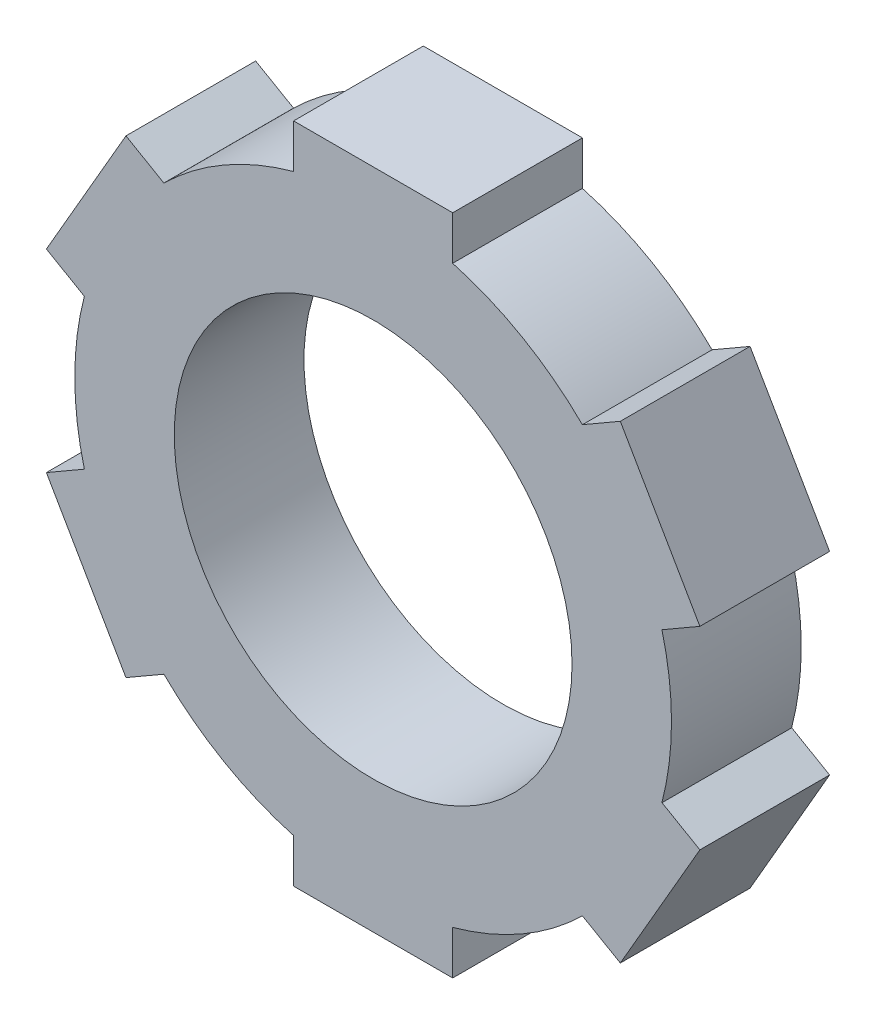
ISO-10303-21;
HEADER;
FILE_DESCRIPTION(('STEP AP214'),'2;1');
FILE_NAME('part.step','',(''),(''),'','','');
FILE_SCHEMA(('AUTOMOTIVE_DESIGN { 1 0 10303 214 1 1 1 1 }'));
ENDSEC;
DATA;
#1=APPLICATION_CONTEXT('core data for automotive mechanical design processes');
#2=APPLICATION_PROTOCOL_DEFINITION('international standard','automotive_design',2000,#1);
#3=PRODUCT_CONTEXT('',#1,'mechanical');
#4=PRODUCT('Part','Part','',(#3));
#5=PRODUCT_RELATED_PRODUCT_CATEGORY('part','',(#4));
#6=PRODUCT_DEFINITION_FORMATION('','',#4);
#7=PRODUCT_DEFINITION_CONTEXT('part definition',#1,'design');
#8=PRODUCT_DEFINITION('design','',#6,#7);
#9=PRODUCT_DEFINITION_SHAPE('','',#8);
#10=(LENGTH_UNIT() NAMED_UNIT(*) SI_UNIT(.MILLI.,.METRE.));
#11=(NAMED_UNIT(*) PLANE_ANGLE_UNIT() SI_UNIT($,.RADIAN.));
#12=(NAMED_UNIT(*) SI_UNIT($,.STERADIAN.) SOLID_ANGLE_UNIT());
#13=UNCERTAINTY_MEASURE_WITH_UNIT(LENGTH_MEASURE(1.E-05),#10,'distance_accuracy_value','');
#14=(GEOMETRIC_REPRESENTATION_CONTEXT(3) GLOBAL_UNCERTAINTY_ASSIGNED_CONTEXT((#13)) GLOBAL_UNIT_ASSIGNED_CONTEXT((#10,
#11,#12)) REPRESENTATION_CONTEXT('',''));
#15=CARTESIAN_POINT('',(0.,0.,0.));
#16=DIRECTION('',(0.,0.,1.));
#17=DIRECTION('',(1.,0.,0.));
#18=AXIS2_PLACEMENT_3D('',#15,#16,#17);
#19=CARTESIAN_POINT('',(0.,0.,3.75));
#20=DIRECTION('',(0.,0.,-1.));
#21=DIRECTION('',(-1.,0.,0.));
#22=AXIS2_PLACEMENT_3D('',#19,#20,#21);
#23=CYLINDRICAL_SURFACE('',#22,17.25);
#24=DIRECTION('',(0.,0.,-1.));
#25=VECTOR('',#24,1.);
#26=CARTESIAN_POINT('',(16.694543239469,4.34220290008433,3.75));
#27=LINE('',#26,#25);
#28=CARTESIAN_POINT('',(16.694543239469,4.34220290008433,3.75));
#29=VERTEX_POINT('',#28);
#30=CARTESIAN_POINT('',(16.694543239469,4.34220290008433,-3.75));
#31=VERTEX_POINT('',#30);
#32=EDGE_CURVE('E326',#29,#31,#27,.T.);
#33=ORIENTED_EDGE('',*,*,#32,.F.);
#34=CARTESIAN_POINT('',(0.,0.,3.75));
#35=DIRECTION('',(0.,0.,1.));
#36=DIRECTION('',(1.,0.,0.));
#37=AXIS2_PLACEMENT_3D('',#34,#35,#36);
#38=CIRCLE('',#37,17.25);
#39=CARTESIAN_POINT('',(16.6945432394691,-4.34220290008398,3.75));
#40=VERTEX_POINT('',#39);
#41=EDGE_CURVE('E283',#40,#29,#38,.T.);
#42=ORIENTED_EDGE('',*,*,#41,.F.);
#43=DIRECTION('',(0.,0.,-1.));
#44=VECTOR('',#43,1.);
#45=CARTESIAN_POINT('',(16.6945432394691,-4.34220290008398,3.75));
#46=LINE('',#45,#44);
#47=CARTESIAN_POINT('',(16.6945432394691,-4.34220290008398,-3.75));
#48=VERTEX_POINT('',#47);
#49=EDGE_CURVE('E352',#48,#40,#46,.F.);
#50=ORIENTED_EDGE('',*,*,#49,.F.);
#51=CARTESIAN_POINT('',(0.,0.,-3.75));
#52=DIRECTION('',(0.,0.,1.));
#53=DIRECTION('',(1.,0.,0.));
#54=AXIS2_PLACEMENT_3D('',#51,#52,#53);
#55=CIRCLE('',#54,17.25);
#56=EDGE_CURVE('E657',#48,#31,#55,.T.);
#57=ORIENTED_EDGE('',*,*,#56,.T.);
#58=EDGE_LOOP('',(#33,#42,#50,#57));
#59=FACE_BOUND('',#58,.T.);
#60=ADVANCED_FACE('F43',(#59),#23,.T.);
#61=DIRECTION('',(0.,0.,-1.));
#62=VECTOR('',#61,1.);
#63=CARTESIAN_POINT('',(12.1077296395937,12.286797099916,3.75));
#64=LINE('',#63,#62);
#65=CARTESIAN_POINT('',(12.1077296395937,12.286797099916,-3.75));
#66=VERTEX_POINT('',#65);
#67=CARTESIAN_POINT('',(12.1077296395937,12.286797099916,3.75));
#68=VERTEX_POINT('',#67);
#69=EDGE_CURVE('E323',#66,#68,#64,.F.);
#70=ORIENTED_EDGE('',*,*,#69,.F.);
#71=CARTESIAN_POINT('',(4.58681359987519,16.629,-3.75));
#72=VERTEX_POINT('',#71);
#73=EDGE_CURVE('E584',#66,#72,#55,.T.);
#74=ORIENTED_EDGE('',*,*,#73,.T.);
#75=DIRECTION('',(0.,0.,-1.));
#76=VECTOR('',#75,1.);
#77=CARTESIAN_POINT('',(4.58681359987519,16.629,3.75));
#78=LINE('',#77,#76);
#79=CARTESIAN_POINT('',(4.58681359987519,16.629,3.75));
#80=VERTEX_POINT('',#79);
#81=EDGE_CURVE('E11',#80,#72,#78,.T.);
#82=ORIENTED_EDGE('',*,*,#81,.F.);
#83=EDGE_CURVE('E593',#68,#80,#38,.T.);
#84=ORIENTED_EDGE('',*,*,#83,.F.);
#85=EDGE_LOOP('',(#70,#74,#82,#84));
#86=FACE_BOUND('',#85,.T.);
#87=ADVANCED_FACE('F654',(#86),#23,.T.);
#88=DIRECTION('',(0.,0.,-1.));
#89=VECTOR('',#88,1.);
#90=CARTESIAN_POINT('',(12.1077296395939,-12.2867970999158,3.75));
#91=LINE('',#90,#89);
#92=CARTESIAN_POINT('',(12.1077296395939,-12.2867970999158,3.75));
#93=VERTEX_POINT('',#92);
#94=CARTESIAN_POINT('',(12.1077296395939,-12.2867970999158,-3.75));
#95=VERTEX_POINT('',#94);
#96=EDGE_CURVE('E375',#93,#95,#91,.T.);
#97=ORIENTED_EDGE('',*,*,#96,.F.);
#98=CARTESIAN_POINT('',(4.58681359987519,-16.629,3.75));
#99=VERTEX_POINT('',#98);
#100=EDGE_CURVE('E702',#99,#93,#38,.T.);
#101=ORIENTED_EDGE('',*,*,#100,.F.);
#102=DIRECTION('',(0.,0.,-1.));
#103=VECTOR('',#102,1.);
#104=CARTESIAN_POINT('',(4.58681359987519,-16.629,3.75));
#105=LINE('',#104,#103);
#106=CARTESIAN_POINT('',(4.58681359987519,-16.629,-3.75));
#107=VERTEX_POINT('',#106);
#108=EDGE_CURVE('E402',#107,#99,#105,.F.);
#109=ORIENTED_EDGE('',*,*,#108,.F.);
#110=EDGE_CURVE('E660',#107,#95,#55,.T.);
#111=ORIENTED_EDGE('',*,*,#110,.T.);
#112=EDGE_LOOP('',(#97,#101,#109,#111));
#113=FACE_BOUND('',#112,.T.);
#114=ADVANCED_FACE('F735',(#113),#23,.T.);
#115=DIRECTION('',(0.,0.,-1.));
#116=VECTOR('',#115,1.);
#117=CARTESIAN_POINT('',(-4.58681359987519,-16.629,3.75));
#118=LINE('',#117,#116);
#119=CARTESIAN_POINT('',(-4.58681359987519,-16.629,3.75));
#120=VERTEX_POINT('',#119);
#121=CARTESIAN_POINT('',(-4.58681359987519,-16.629,-3.75));
#122=VERTEX_POINT('',#121);
#123=EDGE_CURVE('E427',#120,#122,#118,.T.);
#124=ORIENTED_EDGE('',*,*,#123,.F.);
#125=CARTESIAN_POINT('',(-12.1077296395938,-12.2867970999159,3.75));
#126=VERTEX_POINT('',#125);
#127=EDGE_CURVE('E699',#126,#120,#38,.T.);
#128=ORIENTED_EDGE('',*,*,#127,.F.);
#129=DIRECTION('',(0.,0.,-1.));
#130=VECTOR('',#129,1.);
#131=CARTESIAN_POINT('',(-12.1077296395938,-12.2867970999159,3.75));
#132=LINE('',#131,#130);
#133=CARTESIAN_POINT('',(-12.1077296395938,-12.2867970999159,-3.75));
#134=VERTEX_POINT('',#133);
#135=EDGE_CURVE('E454',#134,#126,#132,.F.);
#136=ORIENTED_EDGE('',*,*,#135,.F.);
#137=EDGE_CURVE('E666',#134,#122,#55,.T.);
#138=ORIENTED_EDGE('',*,*,#137,.T.);
#139=EDGE_LOOP('',(#124,#128,#136,#138));
#140=FACE_BOUND('',#139,.T.);
#141=ADVANCED_FACE('F742',(#140),#23,.T.);
#142=DIRECTION('',(0.,0.,-1.));
#143=VECTOR('',#142,1.);
#144=CARTESIAN_POINT('',(-16.694543239469,-4.34220290008422,3.75));
#145=LINE('',#144,#143);
#146=CARTESIAN_POINT('',(-16.694543239469,-4.34220290008422,3.75));
#147=VERTEX_POINT('',#146);
#148=CARTESIAN_POINT('',(-16.694543239469,-4.34220290008422,-3.75));
#149=VERTEX_POINT('',#148);
#150=EDGE_CURVE('E479',#147,#149,#145,.T.);
#151=ORIENTED_EDGE('',*,*,#150,.F.);
#152=CARTESIAN_POINT('',(-16.694543239469,4.34220290008409,3.75));
#153=VERTEX_POINT('',#152);
#154=EDGE_CURVE('E592',#153,#147,#38,.T.);
#155=ORIENTED_EDGE('',*,*,#154,.F.);
#156=DIRECTION('',(0.,0.,-1.));
#157=VECTOR('',#156,1.);
#158=CARTESIAN_POINT('',(-16.694543239469,4.34220290008409,3.75));
#159=LINE('',#158,#157);
#160=CARTESIAN_POINT('',(-16.694543239469,4.34220290008409,-3.75));
#161=VERTEX_POINT('',#160);
#162=EDGE_CURVE('E506',#161,#153,#159,.F.);
#163=ORIENTED_EDGE('',*,*,#162,.F.);
#164=EDGE_CURVE('E597',#161,#149,#55,.T.);
#165=ORIENTED_EDGE('',*,*,#164,.T.);
#166=EDGE_LOOP('',(#151,#155,#163,#165));
#167=FACE_BOUND('',#166,.T.);
#168=ADVANCED_FACE('F683',(#167),#23,.T.);
#169=DIRECTION('',(0.,0.,-1.));
#170=VECTOR('',#169,1.);
#171=CARTESIAN_POINT('',(-12.1077296395939,12.2867970999158,3.75));
#172=LINE('',#171,#170);
#173=CARTESIAN_POINT('',(-12.1077296395939,12.2867970999158,3.75));
#174=VERTEX_POINT('',#173);
#175=CARTESIAN_POINT('',(-12.1077296395939,12.2867970999158,-3.75));
#176=VERTEX_POINT('',#175);
#177=EDGE_CURVE('E531',#174,#176,#172,.T.);
#178=ORIENTED_EDGE('',*,*,#177,.F.);
#179=CARTESIAN_POINT('',(-4.58681359987519,16.629,3.75));
#180=VERTEX_POINT('',#179);
#181=EDGE_CURVE('E588',#180,#174,#38,.T.);
#182=ORIENTED_EDGE('',*,*,#181,.F.);
#183=DIRECTION('',(0.,0.,-1.));
#184=VECTOR('',#183,1.);
#185=CARTESIAN_POINT('',(-4.58681359987519,16.629,3.75));
#186=LINE('',#185,#184);
#187=CARTESIAN_POINT('',(-4.58681359987519,16.629,-3.75));
#188=VERTEX_POINT('',#187);
#189=EDGE_CURVE('E52',#188,#180,#186,.F.);
#190=ORIENTED_EDGE('',*,*,#189,.F.);
#191=EDGE_CURVE('E594',#188,#176,#55,.T.);
#192=ORIENTED_EDGE('',*,*,#191,.T.);
#193=EDGE_LOOP('',(#178,#182,#190,#192));
#194=FACE_BOUND('',#193,.T.);
#195=ADVANCED_FACE('F45',(#194),#23,.T.);
#196=CARTESIAN_POINT('',(0.,0.,3.75));
#197=DIRECTION('',(0.,0.,1.));
#198=DIRECTION('',(1.,0.,0.));
#199=AXIS2_PLACEMENT_3D('',#196,#197,#198);
#200=PLANE('',#199);
#201=ORIENTED_EDGE('',*,*,#41,.T.);
#202=DIRECTION('',(0.50000000000001,-0.866025403784433,0.));
#203=VECTOR('',#202,1.);
#204=CARTESIAN_POINT('',(14.4011364395313,8.31450000000017,3.75));
#205=LINE('',#204,#203);
#206=CARTESIAN_POINT('',(16.7011364395314,4.33078314259178,3.75));
#207=VERTEX_POINT('',#206);
#208=EDGE_CURVE('E275',#29,#207,#205,.T.);
#209=ORIENTED_EDGE('',*,*,#208,.T.);
#210=DIRECTION('',(0.866025403784433,0.500000000000011,0.));
#211=VECTOR('',#210,1.);
#212=CARTESIAN_POINT('',(2.30000000000005,-3.9837168574084,3.75));
#213=LINE('',#212,#211);
#214=CARTESIAN_POINT('',(18.892180711106,5.59578314259181,3.75));
#215=VERTEX_POINT('',#214);
#216=EDGE_CURVE('E281',#207,#215,#213,.T.);
#217=ORIENTED_EDGE('',*,*,#216,.T.);
#218=DIRECTION('',(-0.50000000000001,0.866025403784433,0.));
#219=VECTOR('',#218,1.);
#220=CARTESIAN_POINT('',(16.5921807111059,9.57950000000019,3.75));
#221=LINE('',#220,#219);
#222=CARTESIAN_POINT('',(14.2921807111059,13.5632168574086,3.75));
#223=VERTEX_POINT('',#222);
#224=EDGE_CURVE('E305',#215,#223,#221,.T.);
#225=ORIENTED_EDGE('',*,*,#224,.T.);
#226=DIRECTION('',(-0.866025403784433,-0.500000000000011,0.));
#227=VECTOR('',#226,1.);
#228=CARTESIAN_POINT('',(-2.30000000000005,3.98371685740838,3.75));
#229=LINE('',#228,#227);
#230=CARTESIAN_POINT('',(12.1011364395313,12.2982168574086,3.75));
#231=VERTEX_POINT('',#230);
#232=EDGE_CURVE('E287',#223,#231,#229,.T.);
#233=ORIENTED_EDGE('',*,*,#232,.T.);
#234=EDGE_CURVE('E59',#231,#68,#205,.T.);
#235=ORIENTED_EDGE('',*,*,#234,.T.);
#236=ORIENTED_EDGE('',*,*,#83,.T.);
#237=DIRECTION('',(1.,0.,0.));
#238=VECTOR('',#237,1.);
#239=CARTESIAN_POINT('',(0.,16.629,3.75));
#240=LINE('',#239,#238);
#241=CARTESIAN_POINT('',(4.6,16.629,3.75));
#242=VERTEX_POINT('',#241);
#243=EDGE_CURVE('E559',#80,#242,#240,.T.);
#244=ORIENTED_EDGE('',*,*,#243,.T.);
#245=DIRECTION('',(0.,1.,0.));
#246=VECTOR('',#245,1.);
#247=CARTESIAN_POINT('',(4.60000000000001,0.,3.75));
#248=LINE('',#247,#246);
#249=CARTESIAN_POINT('',(4.6,19.159,3.75));
#250=VERTEX_POINT('',#249);
#251=EDGE_CURVE('E539',#242,#250,#248,.T.);
#252=ORIENTED_EDGE('',*,*,#251,.T.);
#253=DIRECTION('',(-1.,0.,0.));
#254=VECTOR('',#253,1.);
#255=CARTESIAN_POINT('',(0.,19.159,3.75));
#256=LINE('',#255,#254);
#257=CARTESIAN_POINT('',(-4.6,19.159,3.75));
#258=VERTEX_POINT('',#257);
#259=EDGE_CURVE('E564',#250,#258,#256,.T.);
#260=ORIENTED_EDGE('',*,*,#259,.T.);
#261=DIRECTION('',(0.,-1.,0.));
#262=VECTOR('',#261,1.);
#263=CARTESIAN_POINT('',(-4.59999999999999,0.,3.75));
#264=LINE('',#263,#262);
#265=CARTESIAN_POINT('',(-4.6,16.629,3.75));
#266=VERTEX_POINT('',#265);
#267=EDGE_CURVE('E560',#258,#266,#264,.T.);
#268=ORIENTED_EDGE('',*,*,#267,.T.);
#269=EDGE_CURVE('E555',#266,#180,#240,.T.);
#270=ORIENTED_EDGE('',*,*,#269,.T.);
#271=ORIENTED_EDGE('',*,*,#181,.T.);
#272=DIRECTION('',(0.499999999999998,0.86602540378444,0.));
#273=VECTOR('',#272,1.);
#274=CARTESIAN_POINT('',(-14.4011364395314,8.31449999999997,3.75));
#275=LINE('',#274,#273);
#276=CARTESIAN_POINT('',(-12.1011364395315,12.2982168574084,3.75));
#277=VERTEX_POINT('',#276);
#278=EDGE_CURVE('E507',#174,#277,#275,.T.);
#279=ORIENTED_EDGE('',*,*,#278,.T.);
#280=DIRECTION('',(-0.86602540378444,0.499999999999997,0.));
#281=VECTOR('',#280,1.);
#282=CARTESIAN_POINT('',(2.29999999999999,3.98371685740844,3.75));
#283=LINE('',#282,#281);
#284=CARTESIAN_POINT('',(-14.2921807111061,13.5632168574084,3.75));
#285=VERTEX_POINT('',#284);
#286=EDGE_CURVE('E487',#277,#285,#283,.T.);
#287=ORIENTED_EDGE('',*,*,#286,.T.);
#288=DIRECTION('',(-0.499999999999998,-0.86602540378444,0.));
#289=VECTOR('',#288,1.);
#290=CARTESIAN_POINT('',(-16.5921807111061,9.57949999999996,3.75));
#291=LINE('',#290,#289);
#292=CARTESIAN_POINT('',(-18.8921807111061,5.59578314259154,3.75));
#293=VERTEX_POINT('',#292);
#294=EDGE_CURVE('E512',#285,#293,#291,.T.);
#295=ORIENTED_EDGE('',*,*,#294,.T.);
#296=DIRECTION('',(0.86602540378444,-0.499999999999998,0.));
#297=VECTOR('',#296,1.);
#298=CARTESIAN_POINT('',(-2.29999999999999,-3.98371685740842,3.75));
#299=LINE('',#298,#297);
#300=CARTESIAN_POINT('',(-16.7011364395314,4.33078314259154,3.75));
#301=VERTEX_POINT('',#300);
#302=EDGE_CURVE('E508',#293,#301,#299,.T.);
#303=ORIENTED_EDGE('',*,*,#302,.T.);
#304=EDGE_CURVE('E503',#301,#153,#275,.T.);
#305=ORIENTED_EDGE('',*,*,#304,.T.);
#306=ORIENTED_EDGE('',*,*,#154,.T.);
#307=DIRECTION('',(-0.500000000000004,0.866025403784436,0.));
#308=VECTOR('',#307,1.);
#309=CARTESIAN_POINT('',(-14.4011364395314,-8.31450000000007,3.75));
#310=LINE('',#309,#308);
#311=CARTESIAN_POINT('',(-16.7011364395314,-4.33078314259166,3.75));
#312=VERTEX_POINT('',#311);
#313=EDGE_CURVE('E455',#147,#312,#310,.T.);
#314=ORIENTED_EDGE('',*,*,#313,.T.);
#315=DIRECTION('',(-0.866025403784436,-0.500000000000005,0.));
#316=VECTOR('',#315,1.);
#317=CARTESIAN_POINT('',(-2.30000000000003,3.98371685740842,3.75));
#318=LINE('',#317,#316);
#319=CARTESIAN_POINT('',(-18.892180711106,-5.59578314259167,3.75));
#320=VERTEX_POINT('',#319);
#321=EDGE_CURVE('E435',#312,#320,#318,.T.);
#322=ORIENTED_EDGE('',*,*,#321,.T.);
#323=DIRECTION('',(0.500000000000004,-0.866025403784436,0.));
#324=VECTOR('',#323,1.);
#325=CARTESIAN_POINT('',(-16.592180711106,-9.57950000000008,3.75));
#326=LINE('',#325,#324);
#327=CARTESIAN_POINT('',(-14.292180711106,-13.5632168574085,3.75));
#328=VERTEX_POINT('',#327);
#329=EDGE_CURVE('E460',#320,#328,#326,.T.);
#330=ORIENTED_EDGE('',*,*,#329,.T.);
#331=DIRECTION('',(0.866025403784436,0.500000000000004,0.));
#332=VECTOR('',#331,1.);
#333=CARTESIAN_POINT('',(2.30000000000002,-3.9837168574084,3.75));
#334=LINE('',#333,#332);
#335=CARTESIAN_POINT('',(-12.1011364395314,-12.2982168574085,3.75));
#336=VERTEX_POINT('',#335);
#337=EDGE_CURVE('E456',#328,#336,#334,.T.);
#338=ORIENTED_EDGE('',*,*,#337,.T.);
#339=EDGE_CURVE('E451',#336,#126,#310,.T.);
#340=ORIENTED_EDGE('',*,*,#339,.T.);
#341=ORIENTED_EDGE('',*,*,#127,.T.);
#342=DIRECTION('',(-1.,0.,0.));
#343=VECTOR('',#342,1.);
#344=CARTESIAN_POINT('',(0.,-16.629,3.75));
#345=LINE('',#344,#343);
#346=CARTESIAN_POINT('',(-4.6,-16.629,3.75));
#347=VERTEX_POINT('',#346);
#348=EDGE_CURVE('E403',#120,#347,#345,.T.);
#349=ORIENTED_EDGE('',*,*,#348,.T.);
#350=DIRECTION('',(0.,-1.,0.));
#351=VECTOR('',#350,1.);
#352=CARTESIAN_POINT('',(-4.60000000000001,0.,3.75));
#353=LINE('',#352,#351);
#354=CARTESIAN_POINT('',(-4.6,-19.159,3.75));
#355=VERTEX_POINT('',#354);
#356=EDGE_CURVE('E383',#347,#355,#353,.T.);
#357=ORIENTED_EDGE('',*,*,#356,.T.);
#358=DIRECTION('',(1.,0.,0.));
#359=VECTOR('',#358,1.);
#360=CARTESIAN_POINT('',(0.,-19.159,3.75));
#361=LINE('',#360,#359);
#362=CARTESIAN_POINT('',(4.6,-19.159,3.75));
#363=VERTEX_POINT('',#362);
#364=EDGE_CURVE('E408',#355,#363,#361,.T.);
#365=ORIENTED_EDGE('',*,*,#364,.T.);
#366=DIRECTION('',(0.,1.,0.));
#367=VECTOR('',#366,1.);
#368=CARTESIAN_POINT('',(4.59999999999999,0.,3.75));
#369=LINE('',#368,#367);
#370=CARTESIAN_POINT('',(4.6,-16.629,3.75));
#371=VERTEX_POINT('',#370);
#372=EDGE_CURVE('E404',#363,#371,#369,.T.);
#373=ORIENTED_EDGE('',*,*,#372,.T.);
#374=EDGE_CURVE('E399',#371,#99,#345,.T.);
#375=ORIENTED_EDGE('',*,*,#374,.T.);
#376=ORIENTED_EDGE('',*,*,#100,.T.);
#377=DIRECTION('',(-0.499999999999992,-0.866025403784443,0.));
#378=VECTOR('',#377,1.);
#379=CARTESIAN_POINT('',(14.4011364395315,-8.31449999999987,3.75));
#380=LINE('',#379,#378);
#381=CARTESIAN_POINT('',(12.1011364395315,-12.2982168574083,3.75));
#382=VERTEX_POINT('',#381);
#383=EDGE_CURVE('E353',#93,#382,#380,.T.);
#384=ORIENTED_EDGE('',*,*,#383,.T.);
#385=DIRECTION('',(0.866025403784444,-0.499999999999991,0.));
#386=VECTOR('',#385,1.);
#387=CARTESIAN_POINT('',(-2.29999999999997,-3.98371685740845,3.75));
#388=LINE('',#387,#386);
#389=CARTESIAN_POINT('',(14.2921807111062,-13.5632168574083,3.75));
#390=VERTEX_POINT('',#389);
#391=EDGE_CURVE('E334',#382,#390,#388,.T.);
#392=ORIENTED_EDGE('',*,*,#391,.T.);
#393=DIRECTION('',(0.499999999999992,0.866025403784443,0.));
#394=VECTOR('',#393,1.);
#395=CARTESIAN_POINT('',(16.5921807111061,-9.57949999999984,3.75));
#396=LINE('',#395,#394);
#397=CARTESIAN_POINT('',(18.8921807111061,-5.59578314259141,3.75));
#398=VERTEX_POINT('',#397);
#399=EDGE_CURVE('E357',#390,#398,#396,.T.);
#400=ORIENTED_EDGE('',*,*,#399,.T.);
#401=DIRECTION('',(-0.866025403784444,0.499999999999992,0.));
#402=VECTOR('',#401,1.);
#403=CARTESIAN_POINT('',(2.29999999999996,3.98371685740843,3.75));
#404=LINE('',#403,#402);
#405=CARTESIAN_POINT('',(16.7011364395315,-4.33078314259143,3.75));
#406=VERTEX_POINT('',#405);
#407=EDGE_CURVE('E354',#398,#406,#404,.T.);
#408=ORIENTED_EDGE('',*,*,#407,.T.);
#409=EDGE_CURVE('E66',#406,#40,#380,.T.);
#410=ORIENTED_EDGE('',*,*,#409,.T.);
#411=EDGE_LOOP('',(#201,#209,#217,#225,#233,#235,#236,#244,#252,#260,#268,#270,#271,#279,#287,
#295,#303,#305,#306,#314,#322,#330,#338,#340,#341,#349,#357,#365,#373,#375,#376,#384,#392,#400,
#408,#410));
#412=FACE_BOUND('',#411,.T.);
#413=CARTESIAN_POINT('',(0.,0.,3.75));
#414=DIRECTION('',(0.,0.,1.));
#415=DIRECTION('',(1.,0.,0.));
#416=AXIS2_PLACEMENT_3D('',#413,#414,#415);
#417=CIRCLE('',#416,11.5);
#418=CARTESIAN_POINT('',(11.5,0.,3.75));
#419=VERTEX_POINT('',#418);
#420=EDGE_CURVE('E580',#419,#419,#417,.T.);
#421=ORIENTED_EDGE('',*,*,#420,.F.);
#422=EDGE_LOOP('',(#421));
#423=FACE_BOUND('',#422,.T.);
#424=ADVANCED_FACE('F277',(#412,#423),#200,.T.);
#425=CARTESIAN_POINT('',(0.,0.,-3.75));
#426=DIRECTION('',(0.,0.,1.));
#427=DIRECTION('',(1.,0.,0.));
#428=AXIS2_PLACEMENT_3D('',#425,#426,#427);
#429=PLANE('',#428);
#430=ORIENTED_EDGE('',*,*,#73,.F.);
#431=DIRECTION('',(0.50000000000001,-0.866025403784433,0.));
#432=VECTOR('',#431,1.);
#433=CARTESIAN_POINT('',(14.4011364395313,8.31450000000017,-3.75));
#434=LINE('',#433,#432);
#435=CARTESIAN_POINT('',(12.1011364395313,12.2982168574086,-3.75));
#436=VERTEX_POINT('',#435);
#437=EDGE_CURVE('E299',#436,#66,#434,.T.);
#438=ORIENTED_EDGE('',*,*,#437,.F.);
#439=DIRECTION('',(-0.866025403784433,-0.50000000000001,0.));
#440=VECTOR('',#439,1.);
#441=CARTESIAN_POINT('',(-2.30000000000005,3.98371685740838,-3.75));
#442=LINE('',#441,#440);
#443=CARTESIAN_POINT('',(14.2921807111059,13.5632168574086,-3.75));
#444=VERTEX_POINT('',#443);
#445=EDGE_CURVE('E316',#444,#436,#442,.T.);
#446=ORIENTED_EDGE('',*,*,#445,.F.);
#447=DIRECTION('',(-0.50000000000001,0.866025403784433,0.));
#448=VECTOR('',#447,1.);
#449=CARTESIAN_POINT('',(16.5921807111059,9.57950000000019,-3.75));
#450=LINE('',#449,#448);
#451=CARTESIAN_POINT('',(18.892180711106,5.59578314259181,-3.75));
#452=VERTEX_POINT('',#451);
#453=EDGE_CURVE('E317',#452,#444,#450,.T.);
#454=ORIENTED_EDGE('',*,*,#453,.F.);
#455=DIRECTION('',(0.866025403784433,0.500000000000011,0.));
#456=VECTOR('',#455,1.);
#457=CARTESIAN_POINT('',(2.30000000000005,-3.9837168574084,-3.75));
#458=LINE('',#457,#456);
#459=CARTESIAN_POINT('',(16.7011364395314,4.33078314259178,-3.75));
#460=VERTEX_POINT('',#459);
#461=EDGE_CURVE('E298',#460,#452,#458,.T.);
#462=ORIENTED_EDGE('',*,*,#461,.F.);
#463=EDGE_CURVE('E293',#31,#460,#434,.T.);
#464=ORIENTED_EDGE('',*,*,#463,.F.);
#465=ORIENTED_EDGE('',*,*,#56,.F.);
#466=DIRECTION('',(-0.499999999999992,-0.866025403784443,0.));
#467=VECTOR('',#466,1.);
#468=CARTESIAN_POINT('',(14.4011364395315,-8.31449999999987,-3.75));
#469=LINE('',#468,#467);
#470=CARTESIAN_POINT('',(16.7011364395315,-4.33078314259143,-3.75));
#471=VERTEX_POINT('',#470);
#472=EDGE_CURVE('E336',#471,#48,#469,.T.);
#473=ORIENTED_EDGE('',*,*,#472,.F.);
#474=DIRECTION('',(-0.866025403784444,0.499999999999992,0.));
#475=VECTOR('',#474,1.);
#476=CARTESIAN_POINT('',(2.29999999999996,3.98371685740843,-3.75));
#477=LINE('',#476,#475);
#478=CARTESIAN_POINT('',(18.8921807111061,-5.59578314259141,-3.75));
#479=VERTEX_POINT('',#478);
#480=EDGE_CURVE('E340',#479,#471,#477,.T.);
#481=ORIENTED_EDGE('',*,*,#480,.F.);
#482=DIRECTION('',(0.499999999999992,0.866025403784443,0.));
#483=VECTOR('',#482,1.);
#484=CARTESIAN_POINT('',(16.5921807111061,-9.57949999999984,-3.75));
#485=LINE('',#484,#483);
#486=CARTESIAN_POINT('',(14.2921807111062,-13.5632168574083,-3.75));
#487=VERTEX_POINT('',#486);
#488=EDGE_CURVE('E346',#487,#479,#485,.T.);
#489=ORIENTED_EDGE('',*,*,#488,.F.);
#490=DIRECTION('',(0.866025403784444,-0.499999999999991,0.));
#491=VECTOR('',#490,1.);
#492=CARTESIAN_POINT('',(-2.29999999999997,-3.98371685740845,-3.75));
#493=LINE('',#492,#491);
#494=CARTESIAN_POINT('',(12.1011364395315,-12.2982168574083,-3.75));
#495=VERTEX_POINT('',#494);
#496=EDGE_CURVE('E330',#495,#487,#493,.T.);
#497=ORIENTED_EDGE('',*,*,#496,.F.);
#498=EDGE_CURVE('E339',#95,#495,#469,.T.);
#499=ORIENTED_EDGE('',*,*,#498,.F.);
#500=ORIENTED_EDGE('',*,*,#110,.F.);
#501=DIRECTION('',(-1.,0.,0.));
#502=VECTOR('',#501,1.);
#503=CARTESIAN_POINT('',(0.,-16.629,-3.75));
#504=LINE('',#503,#502);
#505=CARTESIAN_POINT('',(4.6,-16.629,-3.75));
#506=VERTEX_POINT('',#505);
#507=EDGE_CURVE('E385',#506,#107,#504,.T.);
#508=ORIENTED_EDGE('',*,*,#507,.F.);
#509=DIRECTION('',(0.,1.,0.));
#510=VECTOR('',#509,1.);
#511=CARTESIAN_POINT('',(4.59999999999999,0.,-3.75));
#512=LINE('',#511,#510);
#513=CARTESIAN_POINT('',(4.6,-19.159,-3.75));
#514=VERTEX_POINT('',#513);
#515=EDGE_CURVE('E389',#514,#506,#512,.T.);
#516=ORIENTED_EDGE('',*,*,#515,.F.);
#517=DIRECTION('',(1.,0.,0.));
#518=VECTOR('',#517,1.);
#519=CARTESIAN_POINT('',(0.,-19.159,-3.75));
#520=LINE('',#519,#518);
#521=CARTESIAN_POINT('',(-4.6,-19.159,-3.75));
#522=VERTEX_POINT('',#521);
#523=EDGE_CURVE('E395',#522,#514,#520,.T.);
#524=ORIENTED_EDGE('',*,*,#523,.F.);
#525=DIRECTION('',(0.,-1.,0.));
#526=VECTOR('',#525,1.);
#527=CARTESIAN_POINT('',(-4.60000000000001,0.,-3.75));
#528=LINE('',#527,#526);
#529=CARTESIAN_POINT('',(-4.6,-16.629,-3.75));
#530=VERTEX_POINT('',#529);
#531=EDGE_CURVE('E379',#530,#522,#528,.T.);
#532=ORIENTED_EDGE('',*,*,#531,.F.);
#533=EDGE_CURVE('E388',#122,#530,#504,.T.);
#534=ORIENTED_EDGE('',*,*,#533,.F.);
#535=ORIENTED_EDGE('',*,*,#137,.F.);
#536=DIRECTION('',(-0.500000000000004,0.866025403784436,0.));
#537=VECTOR('',#536,1.);
#538=CARTESIAN_POINT('',(-14.4011364395314,-8.31450000000007,-3.75));
#539=LINE('',#538,#537);
#540=CARTESIAN_POINT('',(-12.1011364395314,-12.2982168574085,-3.75));
#541=VERTEX_POINT('',#540);
#542=EDGE_CURVE('E437',#541,#134,#539,.T.);
#543=ORIENTED_EDGE('',*,*,#542,.F.);
#544=DIRECTION('',(0.866025403784436,0.500000000000004,0.));
#545=VECTOR('',#544,1.);
#546=CARTESIAN_POINT('',(2.30000000000002,-3.9837168574084,-3.75));
#547=LINE('',#546,#545);
#548=CARTESIAN_POINT('',(-14.292180711106,-13.5632168574085,-3.75));
#549=VERTEX_POINT('',#548);
#550=EDGE_CURVE('E441',#549,#541,#547,.T.);
#551=ORIENTED_EDGE('',*,*,#550,.F.);
#552=DIRECTION('',(0.500000000000004,-0.866025403784436,0.));
#553=VECTOR('',#552,1.);
#554=CARTESIAN_POINT('',(-16.592180711106,-9.57950000000008,-3.75));
#555=LINE('',#554,#553);
#556=CARTESIAN_POINT('',(-18.892180711106,-5.59578314259167,-3.75));
#557=VERTEX_POINT('',#556);
#558=EDGE_CURVE('E447',#557,#549,#555,.T.);
#559=ORIENTED_EDGE('',*,*,#558,.F.);
#560=DIRECTION('',(-0.866025403784436,-0.500000000000005,0.));
#561=VECTOR('',#560,1.);
#562=CARTESIAN_POINT('',(-2.30000000000003,3.98371685740842,-3.75));
#563=LINE('',#562,#561);
#564=CARTESIAN_POINT('',(-16.7011364395314,-4.33078314259166,-3.75));
#565=VERTEX_POINT('',#564);
#566=EDGE_CURVE('E431',#565,#557,#563,.T.);
#567=ORIENTED_EDGE('',*,*,#566,.F.);
#568=EDGE_CURVE('E440',#149,#565,#539,.T.);
#569=ORIENTED_EDGE('',*,*,#568,.F.);
#570=ORIENTED_EDGE('',*,*,#164,.F.);
#571=DIRECTION('',(0.499999999999998,0.86602540378444,0.));
#572=VECTOR('',#571,1.);
#573=CARTESIAN_POINT('',(-14.4011364395314,8.31449999999997,-3.75));
#574=LINE('',#573,#572);
#575=CARTESIAN_POINT('',(-16.7011364395314,4.33078314259154,-3.75));
#576=VERTEX_POINT('',#575);
#577=EDGE_CURVE('E489',#576,#161,#574,.T.);
#578=ORIENTED_EDGE('',*,*,#577,.F.);
#579=DIRECTION('',(0.86602540378444,-0.499999999999998,0.));
#580=VECTOR('',#579,1.);
#581=CARTESIAN_POINT('',(-2.29999999999999,-3.98371685740842,-3.75));
#582=LINE('',#581,#580);
#583=CARTESIAN_POINT('',(-18.8921807111061,5.59578314259154,-3.75));
#584=VERTEX_POINT('',#583);
#585=EDGE_CURVE('E493',#584,#576,#582,.T.);
#586=ORIENTED_EDGE('',*,*,#585,.F.);
#587=DIRECTION('',(-0.499999999999998,-0.86602540378444,0.));
#588=VECTOR('',#587,1.);
#589=CARTESIAN_POINT('',(-16.5921807111061,9.57949999999996,-3.75));
#590=LINE('',#589,#588);
#591=CARTESIAN_POINT('',(-14.2921807111061,13.5632168574084,-3.75));
#592=VERTEX_POINT('',#591);
#593=EDGE_CURVE('E499',#592,#584,#590,.T.);
#594=ORIENTED_EDGE('',*,*,#593,.F.);
#595=DIRECTION('',(-0.86602540378444,0.499999999999997,0.));
#596=VECTOR('',#595,1.);
#597=CARTESIAN_POINT('',(2.29999999999999,3.98371685740844,-3.75));
#598=LINE('',#597,#596);
#599=CARTESIAN_POINT('',(-12.1011364395315,12.2982168574084,-3.75));
#600=VERTEX_POINT('',#599);
#601=EDGE_CURVE('E483',#600,#592,#598,.T.);
#602=ORIENTED_EDGE('',*,*,#601,.F.);
#603=EDGE_CURVE('E492',#176,#600,#574,.T.);
#604=ORIENTED_EDGE('',*,*,#603,.F.);
#605=ORIENTED_EDGE('',*,*,#191,.F.);
#606=DIRECTION('',(1.,0.,0.));
#607=VECTOR('',#606,1.);
#608=CARTESIAN_POINT('',(0.,16.629,-3.75));
#609=LINE('',#608,#607);
#610=CARTESIAN_POINT('',(-4.6,16.629,-3.75));
#611=VERTEX_POINT('',#610);
#612=EDGE_CURVE('E541',#611,#188,#609,.T.);
#613=ORIENTED_EDGE('',*,*,#612,.F.);
#614=DIRECTION('',(0.,-1.,0.));
#615=VECTOR('',#614,1.);
#616=CARTESIAN_POINT('',(-4.59999999999999,0.,-3.75));
#617=LINE('',#616,#615);
#618=CARTESIAN_POINT('',(-4.6,19.159,-3.75));
#619=VERTEX_POINT('',#618);
#620=EDGE_CURVE('E545',#619,#611,#617,.T.);
#621=ORIENTED_EDGE('',*,*,#620,.F.);
#622=DIRECTION('',(-1.,0.,0.));
#623=VECTOR('',#622,1.);
#624=CARTESIAN_POINT('',(0.,19.159,-3.75));
#625=LINE('',#624,#623);
#626=CARTESIAN_POINT('',(4.6,19.159,-3.75));
#627=VERTEX_POINT('',#626);
#628=EDGE_CURVE('E551',#627,#619,#625,.T.);
#629=ORIENTED_EDGE('',*,*,#628,.F.);
#630=DIRECTION('',(0.,1.,0.));
#631=VECTOR('',#630,1.);
#632=CARTESIAN_POINT('',(4.60000000000001,0.,-3.75));
#633=LINE('',#632,#631);
#634=CARTESIAN_POINT('',(4.6,16.629,-3.75));
#635=VERTEX_POINT('',#634);
#636=EDGE_CURVE('E535',#635,#627,#633,.T.);
#637=ORIENTED_EDGE('',*,*,#636,.F.);
#638=EDGE_CURVE('E544',#72,#635,#609,.T.);
#639=ORIENTED_EDGE('',*,*,#638,.F.);
#640=EDGE_LOOP('',(#430,#438,#446,#454,#462,#464,#465,#473,#481,#489,#497,#499,#500,#508,#516,
#524,#532,#534,#535,#543,#551,#559,#567,#569,#570,#578,#586,#594,#602,#604,#605,#613,#621,#629,
#637,#639));
#641=FACE_BOUND('',#640,.T.);
#642=CARTESIAN_POINT('',(0.,0.,-3.75));
#643=DIRECTION('',(0.,0.,1.));
#644=DIRECTION('',(1.,0.,0.));
#645=AXIS2_PLACEMENT_3D('',#642,#643,#644);
#646=CIRCLE('',#645,11.5);
#647=CARTESIAN_POINT('',(11.5,0.,-3.75));
#648=VERTEX_POINT('',#647);
#649=EDGE_CURVE('E558',#648,#648,#646,.T.);
#650=ORIENTED_EDGE('',*,*,#649,.T.);
#651=EDGE_LOOP('',(#650));
#652=FACE_BOUND('',#651,.T.);
#653=ADVANCED_FACE('F621',(#641,#652),#429,.F.);
#654=CARTESIAN_POINT('',(0.,0.,3.75));
#655=DIRECTION('',(0.,0.,-1.));
#656=DIRECTION('',(-1.,0.,0.));
#657=AXIS2_PLACEMENT_3D('',#654,#655,#656);
#658=CYLINDRICAL_SURFACE('',#657,11.5);
#659=ORIENTED_EDGE('',*,*,#420,.T.);
#660=EDGE_LOOP('',(#659));
#661=FACE_BOUND('',#660,.T.);
#662=ORIENTED_EDGE('',*,*,#649,.F.);
#663=EDGE_LOOP('',(#662));
#664=FACE_BOUND('',#663,.T.);
#665=ADVANCED_FACE('F869',(#661,#664),#658,.F.);
#666=CARTESIAN_POINT('',(0.,16.629,13.2915355158381));
#667=DIRECTION('',(0.,1.,0.));
#668=DIRECTION('',(0.,0.,1.));
#669=AXIS2_PLACEMENT_3D('',#666,#667,#668);
#670=PLANE('',#669);
#671=ORIENTED_EDGE('',*,*,#243,.F.);
#672=ORIENTED_EDGE('',*,*,#81,.T.);
#673=ORIENTED_EDGE('',*,*,#638,.T.);
#674=DIRECTION('',(0.,0.,-1.));
#675=VECTOR('',#674,1.);
#676=CARTESIAN_POINT('',(4.6,16.629,13.2915355158381));
#677=LINE('',#676,#675);
#678=EDGE_CURVE('E540',#242,#635,#677,.T.);
#679=ORIENTED_EDGE('',*,*,#678,.F.);
#680=EDGE_LOOP('',(#671,#672,#673,#679));
#681=FACE_BOUND('',#680,.T.);
#682=ADVANCED_FACE('F712',(#681),#670,.F.);
#683=ORIENTED_EDGE('',*,*,#612,.T.);
#684=ORIENTED_EDGE('',*,*,#189,.T.);
#685=ORIENTED_EDGE('',*,*,#269,.F.);
#686=DIRECTION('',(0.,0.,-1.));
#687=VECTOR('',#686,1.);
#688=CARTESIAN_POINT('',(-4.6,16.629,13.2915355158381));
#689=LINE('',#688,#687);
#690=EDGE_CURVE('E549',#266,#611,#689,.T.);
#691=ORIENTED_EDGE('',*,*,#690,.T.);
#692=EDGE_LOOP('',(#683,#684,#685,#691));
#693=FACE_BOUND('',#692,.T.);
#694=ADVANCED_FACE('F603',(#693),#670,.F.);
#695=CARTESIAN_POINT('',(0.,19.159,13.2915355158381));
#696=DIRECTION('',(0.,-1.,0.));
#697=DIRECTION('',(0.,0.,-1.));
#698=AXIS2_PLACEMENT_3D('',#695,#696,#697);
#699=PLANE('',#698);
#700=ORIENTED_EDGE('',*,*,#259,.F.);
#701=DIRECTION('',(0.,0.,-1.));
#702=VECTOR('',#701,1.);
#703=CARTESIAN_POINT('',(4.6,19.159,13.2915355158381));
#704=LINE('',#703,#702);
#705=EDGE_CURVE('E534',#250,#627,#704,.T.);
#706=ORIENTED_EDGE('',*,*,#705,.T.);
#707=ORIENTED_EDGE('',*,*,#628,.T.);
#708=DIRECTION('',(0.,0.,-1.));
#709=VECTOR('',#708,1.);
#710=CARTESIAN_POINT('',(-4.6,19.159,13.2915355158381));
#711=LINE('',#710,#709);
#712=EDGE_CURVE('E550',#258,#619,#711,.T.);
#713=ORIENTED_EDGE('',*,*,#712,.F.);
#714=EDGE_LOOP('',(#700,#706,#707,#713));
#715=FACE_BOUND('',#714,.T.);
#716=ADVANCED_FACE('F616',(#715),#699,.F.);
#717=CARTESIAN_POINT('',(-4.59999999999999,0.,13.2915355158381));
#718=DIRECTION('',(1.,0.,0.));
#719=DIRECTION('',(0.,1.,0.));
#720=AXIS2_PLACEMENT_3D('',#717,#718,#719);
#721=PLANE('',#720);
#722=ORIENTED_EDGE('',*,*,#267,.F.);
#723=ORIENTED_EDGE('',*,*,#712,.T.);
#724=ORIENTED_EDGE('',*,*,#620,.T.);
#725=ORIENTED_EDGE('',*,*,#690,.F.);
#726=EDGE_LOOP('',(#722,#723,#724,#725));
#727=FACE_BOUND('',#726,.T.);
#728=ADVANCED_FACE('F613',(#727),#721,.F.);
#729=CARTESIAN_POINT('',(4.60000000000001,0.,13.2915355158381));
#730=DIRECTION('',(-1.,0.,0.));
#731=DIRECTION('',(0.,-1.,0.));
#732=AXIS2_PLACEMENT_3D('',#729,#730,#731);
#733=PLANE('',#732);
#734=ORIENTED_EDGE('',*,*,#251,.F.);
#735=ORIENTED_EDGE('',*,*,#678,.T.);
#736=ORIENTED_EDGE('',*,*,#636,.T.);
#737=ORIENTED_EDGE('',*,*,#705,.F.);
#738=EDGE_LOOP('',(#734,#735,#736,#737));
#739=FACE_BOUND('',#738,.T.);
#740=ADVANCED_FACE('F718',(#739),#733,.F.);
#741=CARTESIAN_POINT('',(-14.4011364395314,8.31449999999997,15.2110695223863));
#742=DIRECTION('',(-0.86602540378444,0.499999999999998,0.));
#743=DIRECTION('',(-0.499999999999998,-0.86602540378444,0.));
#744=AXIS2_PLACEMENT_3D('',#741,#742,#743);
#745=PLANE('',#744);
#746=ORIENTED_EDGE('',*,*,#278,.F.);
#747=ORIENTED_EDGE('',*,*,#177,.T.);
#748=ORIENTED_EDGE('',*,*,#603,.T.);
#749=DIRECTION('',(0.,0.,-1.));
#750=VECTOR('',#749,1.);
#751=CARTESIAN_POINT('',(-12.1011364395315,12.2982168574084,15.2110695223863));
#752=LINE('',#751,#750);
#753=EDGE_CURVE('E488',#277,#600,#752,.T.);
#754=ORIENTED_EDGE('',*,*,#753,.F.);
#755=EDGE_LOOP('',(#746,#747,#748,#754));
#756=FACE_BOUND('',#755,.T.);
#757=ADVANCED_FACE('F720',(#756),#745,.F.);
#758=ORIENTED_EDGE('',*,*,#577,.T.);
#759=ORIENTED_EDGE('',*,*,#162,.T.);
#760=ORIENTED_EDGE('',*,*,#304,.F.);
#761=DIRECTION('',(0.,0.,-1.));
#762=VECTOR('',#761,1.);
#763=CARTESIAN_POINT('',(-16.7011364395314,4.33078314259154,15.2110695223863));
#764=LINE('',#763,#762);
#765=EDGE_CURVE('E497',#301,#576,#764,.T.);
#766=ORIENTED_EDGE('',*,*,#765,.T.);
#767=EDGE_LOOP('',(#758,#759,#760,#766));
#768=FACE_BOUND('',#767,.T.);
#769=ADVANCED_FACE('F726',(#768),#745,.F.);
#770=CARTESIAN_POINT('',(-16.5921807111061,9.57949999999996,15.2110695223863));
#771=DIRECTION('',(0.86602540378444,-0.499999999999998,0.));
#772=DIRECTION('',(0.499999999999998,0.86602540378444,0.));
#773=AXIS2_PLACEMENT_3D('',#770,#771,#772);
#774=PLANE('',#773);
#775=ORIENTED_EDGE('',*,*,#294,.F.);
#776=DIRECTION('',(0.,0.,-1.));
#777=VECTOR('',#776,1.);
#778=CARTESIAN_POINT('',(-14.2921807111061,13.5632168574084,15.2110695223863));
#779=LINE('',#778,#777);
#780=EDGE_CURVE('E482',#285,#592,#779,.T.);
#781=ORIENTED_EDGE('',*,*,#780,.T.);
#782=ORIENTED_EDGE('',*,*,#593,.T.);
#783=DIRECTION('',(0.,0.,-1.));
#784=VECTOR('',#783,1.);
#785=CARTESIAN_POINT('',(-18.8921807111061,5.59578314259154,15.2110695223863));
#786=LINE('',#785,#784);
#787=EDGE_CURVE('E498',#293,#584,#786,.T.);
#788=ORIENTED_EDGE('',*,*,#787,.F.);
#789=EDGE_LOOP('',(#775,#781,#782,#788));
#790=FACE_BOUND('',#789,.T.);
#791=ADVANCED_FACE('F841',(#790),#774,.F.);
#792=CARTESIAN_POINT('',(-2.29999999999999,-3.98371685740842,15.2110695223863));
#793=DIRECTION('',(0.499999999999998,0.86602540378444,0.));
#794=DIRECTION('',(-0.86602540378444,0.499999999999998,0.));
#795=AXIS2_PLACEMENT_3D('',#792,#793,#794);
#796=PLANE('',#795);
#797=ORIENTED_EDGE('',*,*,#302,.F.);
#798=ORIENTED_EDGE('',*,*,#787,.T.);
#799=ORIENTED_EDGE('',*,*,#585,.T.);
#800=ORIENTED_EDGE('',*,*,#765,.F.);
#801=EDGE_LOOP('',(#797,#798,#799,#800));
#802=FACE_BOUND('',#801,.T.);
#803=ADVANCED_FACE('F837',(#802),#796,.F.);
#804=CARTESIAN_POINT('',(2.29999999999999,3.98371685740844,15.2110695223863));
#805=DIRECTION('',(-0.499999999999997,-0.86602540378444,0.));
#806=DIRECTION('',(0.86602540378444,-0.499999999999997,0.));
#807=AXIS2_PLACEMENT_3D('',#804,#805,#806);
#808=PLANE('',#807);
#809=ORIENTED_EDGE('',*,*,#286,.F.);
#810=ORIENTED_EDGE('',*,*,#753,.T.);
#811=ORIENTED_EDGE('',*,*,#601,.T.);
#812=ORIENTED_EDGE('',*,*,#780,.F.);
#813=EDGE_LOOP('',(#809,#810,#811,#812));
#814=FACE_BOUND('',#813,.T.);
#815=ADVANCED_FACE('F828',(#814),#808,.F.);
#816=CARTESIAN_POINT('',(-14.4011364395314,-8.31450000000007,15.2110695223864));
#817=DIRECTION('',(-0.866025403784436,-0.500000000000004,0.));
#818=DIRECTION('',(0.500000000000004,-0.866025403784436,0.));
#819=AXIS2_PLACEMENT_3D('',#816,#817,#818);
#820=PLANE('',#819);
#821=ORIENTED_EDGE('',*,*,#313,.F.);
#822=ORIENTED_EDGE('',*,*,#150,.T.);
#823=ORIENTED_EDGE('',*,*,#568,.T.);
#824=DIRECTION('',(0.,0.,-1.));
#825=VECTOR('',#824,1.);
#826=CARTESIAN_POINT('',(-16.7011364395314,-4.33078314259166,15.2110695223864));
#827=LINE('',#826,#825);
#828=EDGE_CURVE('E436',#312,#565,#827,.T.);
#829=ORIENTED_EDGE('',*,*,#828,.F.);
#830=EDGE_LOOP('',(#821,#822,#823,#829));
#831=FACE_BOUND('',#830,.T.);
#832=ADVANCED_FACE('F693',(#831),#820,.F.);
#833=ORIENTED_EDGE('',*,*,#542,.T.);
#834=ORIENTED_EDGE('',*,*,#135,.T.);
#835=ORIENTED_EDGE('',*,*,#339,.F.);
#836=DIRECTION('',(0.,0.,-1.));
#837=VECTOR('',#836,1.);
#838=CARTESIAN_POINT('',(-12.1011364395314,-12.2982168574085,15.2110695223864));
#839=LINE('',#838,#837);
#840=EDGE_CURVE('E445',#336,#541,#839,.T.);
#841=ORIENTED_EDGE('',*,*,#840,.T.);
#842=EDGE_LOOP('',(#833,#834,#835,#841));
#843=FACE_BOUND('',#842,.T.);
#844=ADVANCED_FACE('F827',(#843),#820,.F.);
#845=CARTESIAN_POINT('',(-16.592180711106,-9.57950000000008,15.2110695223864));
#846=DIRECTION('',(0.866025403784436,0.500000000000004,0.));
#847=DIRECTION('',(-0.500000000000004,0.866025403784436,0.));
#848=AXIS2_PLACEMENT_3D('',#845,#846,#847);
#849=PLANE('',#848);
#850=ORIENTED_EDGE('',*,*,#329,.F.);
#851=DIRECTION('',(0.,0.,-1.));
#852=VECTOR('',#851,1.);
#853=CARTESIAN_POINT('',(-18.892180711106,-5.59578314259167,15.2110695223864));
#854=LINE('',#853,#852);
#855=EDGE_CURVE('E430',#320,#557,#854,.T.);
#856=ORIENTED_EDGE('',*,*,#855,.T.);
#857=ORIENTED_EDGE('',*,*,#558,.T.);
#858=DIRECTION('',(0.,0.,-1.));
#859=VECTOR('',#858,1.);
#860=CARTESIAN_POINT('',(-14.292180711106,-13.5632168574085,15.2110695223864));
#861=LINE('',#860,#859);
#862=EDGE_CURVE('E446',#328,#549,#861,.T.);
#863=ORIENTED_EDGE('',*,*,#862,.F.);
#864=EDGE_LOOP('',(#850,#856,#857,#863));
#865=FACE_BOUND('',#864,.T.);
#866=ADVANCED_FACE('F831',(#865),#849,.F.);
#867=CARTESIAN_POINT('',(2.30000000000002,-3.9837168574084,15.2110695223864));
#868=DIRECTION('',(-0.500000000000004,0.866025403784436,0.));
#869=DIRECTION('',(-0.866025403784436,-0.500000000000004,0.));
#870=AXIS2_PLACEMENT_3D('',#867,#868,#869);
#871=PLANE('',#870);
#872=ORIENTED_EDGE('',*,*,#337,.F.);
#873=ORIENTED_EDGE('',*,*,#862,.T.);
#874=ORIENTED_EDGE('',*,*,#550,.T.);
#875=ORIENTED_EDGE('',*,*,#840,.F.);
#876=EDGE_LOOP('',(#872,#873,#874,#875));
#877=FACE_BOUND('',#876,.T.);
#878=ADVANCED_FACE('F824',(#877),#871,.F.);
#879=CARTESIAN_POINT('',(-2.30000000000003,3.98371685740842,15.2110695223864));
#880=DIRECTION('',(0.500000000000005,-0.866025403784436,0.));
#881=DIRECTION('',(0.866025403784436,0.500000000000005,0.));
#882=AXIS2_PLACEMENT_3D('',#879,#880,#881);
#883=PLANE('',#882);
#884=ORIENTED_EDGE('',*,*,#321,.F.);
#885=ORIENTED_EDGE('',*,*,#828,.T.);
#886=ORIENTED_EDGE('',*,*,#566,.T.);
#887=ORIENTED_EDGE('',*,*,#855,.F.);
#888=EDGE_LOOP('',(#884,#885,#886,#887));
#889=FACE_BOUND('',#888,.T.);
#890=ADVANCED_FACE('F696',(#889),#883,.F.);
#891=CARTESIAN_POINT('',(0.,-16.629,13.2915355158381));
#892=DIRECTION('',(0.,-1.,0.));
#893=DIRECTION('',(0.,0.,-1.));
#894=AXIS2_PLACEMENT_3D('',#891,#892,#893);
#895=PLANE('',#894);
#896=ORIENTED_EDGE('',*,*,#348,.F.);
#897=ORIENTED_EDGE('',*,*,#123,.T.);
#898=ORIENTED_EDGE('',*,*,#533,.T.);
#899=DIRECTION('',(0.,0.,-1.));
#900=VECTOR('',#899,1.);
#901=CARTESIAN_POINT('',(-4.6,-16.629,13.2915355158381));
#902=LINE('',#901,#900);
#903=EDGE_CURVE('E384',#347,#530,#902,.T.);
#904=ORIENTED_EDGE('',*,*,#903,.F.);
#905=EDGE_LOOP('',(#896,#897,#898,#904));
#906=FACE_BOUND('',#905,.T.);
#907=ADVANCED_FACE('F751',(#906),#895,.F.);
#908=ORIENTED_EDGE('',*,*,#507,.T.);
#909=ORIENTED_EDGE('',*,*,#108,.T.);
#910=ORIENTED_EDGE('',*,*,#374,.F.);
#911=DIRECTION('',(0.,0.,-1.));
#912=VECTOR('',#911,1.);
#913=CARTESIAN_POINT('',(4.6,-16.629,13.2915355158381));
#914=LINE('',#913,#912);
#915=EDGE_CURVE('E393',#371,#506,#914,.T.);
#916=ORIENTED_EDGE('',*,*,#915,.T.);
#917=EDGE_LOOP('',(#908,#909,#910,#916));
#918=FACE_BOUND('',#917,.T.);
#919=ADVANCED_FACE('F770',(#918),#895,.F.);
#920=CARTESIAN_POINT('',(0.,-19.159,13.2915355158381));
#921=DIRECTION('',(0.,1.,0.));
#922=DIRECTION('',(0.,0.,1.));
#923=AXIS2_PLACEMENT_3D('',#920,#921,#922);
#924=PLANE('',#923);
#925=ORIENTED_EDGE('',*,*,#364,.F.);
#926=DIRECTION('',(0.,0.,-1.));
#927=VECTOR('',#926,1.);
#928=CARTESIAN_POINT('',(-4.6,-19.159,13.2915355158381));
#929=LINE('',#928,#927);
#930=EDGE_CURVE('E378',#355,#522,#929,.T.);
#931=ORIENTED_EDGE('',*,*,#930,.T.);
#932=ORIENTED_EDGE('',*,*,#523,.T.);
#933=DIRECTION('',(0.,0.,-1.));
#934=VECTOR('',#933,1.);
#935=CARTESIAN_POINT('',(4.6,-19.159,13.2915355158381));
#936=LINE('',#935,#934);
#937=EDGE_CURVE('E394',#363,#514,#936,.T.);
#938=ORIENTED_EDGE('',*,*,#937,.F.);
#939=EDGE_LOOP('',(#925,#931,#932,#938));
#940=FACE_BOUND('',#939,.T.);
#941=ADVANCED_FACE('F763',(#940),#924,.F.);
#942=CARTESIAN_POINT('',(4.59999999999999,0.,13.2915355158381));
#943=DIRECTION('',(-1.,0.,0.));
#944=DIRECTION('',(0.,-1.,0.));
#945=AXIS2_PLACEMENT_3D('',#942,#943,#944);
#946=PLANE('',#945);
#947=ORIENTED_EDGE('',*,*,#372,.F.);
#948=ORIENTED_EDGE('',*,*,#937,.T.);
#949=ORIENTED_EDGE('',*,*,#515,.T.);
#950=ORIENTED_EDGE('',*,*,#915,.F.);
#951=EDGE_LOOP('',(#947,#948,#949,#950));
#952=FACE_BOUND('',#951,.T.);
#953=ADVANCED_FACE('F765',(#952),#946,.F.);
#954=CARTESIAN_POINT('',(-4.60000000000001,0.,13.2915355158381));
#955=DIRECTION('',(1.,0.,0.));
#956=DIRECTION('',(0.,1.,0.));
#957=AXIS2_PLACEMENT_3D('',#954,#955,#956);
#958=PLANE('',#957);
#959=ORIENTED_EDGE('',*,*,#356,.F.);
#960=ORIENTED_EDGE('',*,*,#903,.T.);
#961=ORIENTED_EDGE('',*,*,#531,.T.);
#962=ORIENTED_EDGE('',*,*,#930,.F.);
#963=EDGE_LOOP('',(#959,#960,#961,#962));
#964=FACE_BOUND('',#963,.T.);
#965=ADVANCED_FACE('F759',(#964),#958,.F.);
#966=CARTESIAN_POINT('',(14.4011364395315,-8.31449999999987,15.2110695223863));
#967=DIRECTION('',(0.866025403784443,-0.499999999999992,0.));
#968=DIRECTION('',(0.499999999999992,0.866025403784443,0.));
#969=AXIS2_PLACEMENT_3D('',#966,#967,#968);
#970=PLANE('',#969);
#971=ORIENTED_EDGE('',*,*,#383,.F.);
#972=ORIENTED_EDGE('',*,*,#96,.T.);
#973=ORIENTED_EDGE('',*,*,#498,.T.);
#974=DIRECTION('',(0.,0.,-1.));
#975=VECTOR('',#974,1.);
#976=CARTESIAN_POINT('',(12.1011364395315,-12.2982168574083,15.2110695223863));
#977=LINE('',#976,#975);
#978=EDGE_CURVE('E335',#382,#495,#977,.T.);
#979=ORIENTED_EDGE('',*,*,#978,.F.);
#980=EDGE_LOOP('',(#971,#972,#973,#979));
#981=FACE_BOUND('',#980,.T.);
#982=ADVANCED_FACE('F772',(#981),#970,.F.);
#983=ORIENTED_EDGE('',*,*,#472,.T.);
#984=ORIENTED_EDGE('',*,*,#49,.T.);
#985=ORIENTED_EDGE('',*,*,#409,.F.);
#986=DIRECTION('',(0.,0.,-1.));
#987=VECTOR('',#986,1.);
#988=CARTESIAN_POINT('',(16.7011364395315,-4.33078314259143,15.2110695223863));
#989=LINE('',#988,#987);
#990=EDGE_CURVE('E344',#406,#471,#989,.T.);
#991=ORIENTED_EDGE('',*,*,#990,.T.);
#992=EDGE_LOOP('',(#983,#984,#985,#991));
#993=FACE_BOUND('',#992,.T.);
#994=ADVANCED_FACE('F789',(#993),#970,.F.);
#995=CARTESIAN_POINT('',(16.5921807111061,-9.57949999999984,15.2110695223863));
#996=DIRECTION('',(-0.866025403784443,0.499999999999992,0.));
#997=DIRECTION('',(-0.499999999999992,-0.866025403784443,0.));
#998=AXIS2_PLACEMENT_3D('',#995,#996,#997);
#999=PLANE('',#998);
#1000=ORIENTED_EDGE('',*,*,#399,.F.);
#1001=DIRECTION('',(0.,0.,-1.));
#1002=VECTOR('',#1001,1.);
#1003=CARTESIAN_POINT('',(14.2921807111062,-13.5632168574083,15.2110695223863));
#1004=LINE('',#1003,#1002);
#1005=EDGE_CURVE('E329',#390,#487,#1004,.T.);
#1006=ORIENTED_EDGE('',*,*,#1005,.T.);
#1007=ORIENTED_EDGE('',*,*,#488,.T.);
#1008=DIRECTION('',(0.,0.,-1.));
#1009=VECTOR('',#1008,1.);
#1010=CARTESIAN_POINT('',(18.8921807111061,-5.59578314259141,15.2110695223863));
#1011=LINE('',#1010,#1009);
#1012=EDGE_CURVE('E345',#398,#479,#1011,.T.);
#1013=ORIENTED_EDGE('',*,*,#1012,.F.);
#1014=EDGE_LOOP('',(#1000,#1006,#1007,#1013));
#1015=FACE_BOUND('',#1014,.T.);
#1016=ADVANCED_FACE('F783',(#1015),#999,.F.);
#1017=CARTESIAN_POINT('',(2.29999999999996,3.98371685740843,15.2110695223863));
#1018=DIRECTION('',(-0.499999999999992,-0.866025403784444,0.));
#1019=DIRECTION('',(0.866025403784444,-0.499999999999992,0.));
#1020=AXIS2_PLACEMENT_3D('',#1017,#1018,#1019);
#1021=PLANE('',#1020);
#1022=ORIENTED_EDGE('',*,*,#407,.F.);
#1023=ORIENTED_EDGE('',*,*,#1012,.T.);
#1024=ORIENTED_EDGE('',*,*,#480,.T.);
#1025=ORIENTED_EDGE('',*,*,#990,.F.);
#1026=EDGE_LOOP('',(#1022,#1023,#1024,#1025));
#1027=FACE_BOUND('',#1026,.T.);
#1028=ADVANCED_FACE('F785',(#1027),#1021,.F.);
#1029=CARTESIAN_POINT('',(-2.29999999999997,-3.98371685740845,15.2110695223863));
#1030=DIRECTION('',(0.499999999999991,0.866025403784444,0.));
#1031=DIRECTION('',(-0.866025403784444,0.499999999999991,0.));
#1032=AXIS2_PLACEMENT_3D('',#1029,#1030,#1031);
#1033=PLANE('',#1032);
#1034=ORIENTED_EDGE('',*,*,#391,.F.);
#1035=ORIENTED_EDGE('',*,*,#978,.T.);
#1036=ORIENTED_EDGE('',*,*,#496,.T.);
#1037=ORIENTED_EDGE('',*,*,#1005,.F.);
#1038=EDGE_LOOP('',(#1034,#1035,#1036,#1037));
#1039=FACE_BOUND('',#1038,.T.);
#1040=ADVANCED_FACE('F779',(#1039),#1033,.F.);
#1041=CARTESIAN_POINT('',(14.4011364395313,8.31450000000017,15.2110695223864));
#1042=DIRECTION('',(0.866025403784433,0.50000000000001,0.));
#1043=DIRECTION('',(-0.50000000000001,0.866025403784433,0.));
#1044=AXIS2_PLACEMENT_3D('',#1041,#1042,#1043);
#1045=PLANE('',#1044);
#1046=ORIENTED_EDGE('',*,*,#208,.F.);
#1047=ORIENTED_EDGE('',*,*,#32,.T.);
#1048=ORIENTED_EDGE('',*,*,#463,.T.);
#1049=DIRECTION('',(0.,0.,-1.));
#1050=VECTOR('',#1049,1.);
#1051=CARTESIAN_POINT('',(16.7011364395314,4.33078314259178,15.2110695223864));
#1052=LINE('',#1051,#1050);
#1053=EDGE_CURVE('E290',#207,#460,#1052,.T.);
#1054=ORIENTED_EDGE('',*,*,#1053,.F.);
#1055=EDGE_LOOP('',(#1046,#1047,#1048,#1054));
#1056=FACE_BOUND('',#1055,.T.);
#1057=ADVANCED_FACE('F291',(#1056),#1045,.F.);
#1058=ORIENTED_EDGE('',*,*,#437,.T.);
#1059=ORIENTED_EDGE('',*,*,#69,.T.);
#1060=ORIENTED_EDGE('',*,*,#234,.F.);
#1061=DIRECTION('',(0.,0.,-1.));
#1062=VECTOR('',#1061,1.);
#1063=CARTESIAN_POINT('',(12.1011364395313,12.2982168574086,15.2110695223864));
#1064=LINE('',#1063,#1062);
#1065=EDGE_CURVE('E318',#231,#436,#1064,.T.);
#1066=ORIENTED_EDGE('',*,*,#1065,.T.);
#1067=EDGE_LOOP('',(#1058,#1059,#1060,#1066));
#1068=FACE_BOUND('',#1067,.T.);
#1069=ADVANCED_FACE('F649',(#1068),#1045,.F.);
#1070=CARTESIAN_POINT('',(16.5921807111059,9.57950000000019,15.2110695223864));
#1071=DIRECTION('',(-0.866025403784433,-0.50000000000001,0.));
#1072=DIRECTION('',(0.50000000000001,-0.866025403784433,0.));
#1073=AXIS2_PLACEMENT_3D('',#1070,#1071,#1072);
#1074=PLANE('',#1073);
#1075=ORIENTED_EDGE('',*,*,#224,.F.);
#1076=DIRECTION('',(0.,0.,-1.));
#1077=VECTOR('',#1076,1.);
#1078=CARTESIAN_POINT('',(18.892180711106,5.59578314259181,15.2110695223864));
#1079=LINE('',#1078,#1077);
#1080=EDGE_CURVE('E302',#215,#452,#1079,.T.);
#1081=ORIENTED_EDGE('',*,*,#1080,.T.);
#1082=ORIENTED_EDGE('',*,*,#453,.T.);
#1083=DIRECTION('',(0.,0.,-1.));
#1084=VECTOR('',#1083,1.);
#1085=CARTESIAN_POINT('',(14.2921807111059,13.5632168574086,15.2110695223864));
#1086=LINE('',#1085,#1084);
#1087=EDGE_CURVE('E313',#223,#444,#1086,.T.);
#1088=ORIENTED_EDGE('',*,*,#1087,.F.);
#1089=EDGE_LOOP('',(#1075,#1081,#1082,#1088));
#1090=FACE_BOUND('',#1089,.T.);
#1091=ADVANCED_FACE('F793',(#1090),#1074,.F.);
#1092=CARTESIAN_POINT('',(-2.30000000000005,3.98371685740838,15.2110695223864));
#1093=DIRECTION('',(0.500000000000011,-0.866025403784433,0.));
#1094=DIRECTION('',(0.866025403784433,0.500000000000011,0.));
#1095=AXIS2_PLACEMENT_3D('',#1092,#1093,#1094);
#1096=PLANE('',#1095);
#1097=ORIENTED_EDGE('',*,*,#232,.F.);
#1098=ORIENTED_EDGE('',*,*,#1087,.T.);
#1099=ORIENTED_EDGE('',*,*,#445,.T.);
#1100=ORIENTED_EDGE('',*,*,#1065,.F.);
#1101=EDGE_LOOP('',(#1097,#1098,#1099,#1100));
#1102=FACE_BOUND('',#1101,.T.);
#1103=ADVANCED_FACE('F795',(#1102),#1096,.F.);
#1104=CARTESIAN_POINT('',(2.30000000000005,-3.9837168574084,15.2110695223864));
#1105=DIRECTION('',(-0.500000000000011,0.866025403784433,0.));
#1106=DIRECTION('',(-0.866025403784433,-0.500000000000011,0.));
#1107=AXIS2_PLACEMENT_3D('',#1104,#1105,#1106);
#1108=PLANE('',#1107);
#1109=ORIENTED_EDGE('',*,*,#216,.F.);
#1110=ORIENTED_EDGE('',*,*,#1053,.T.);
#1111=ORIENTED_EDGE('',*,*,#461,.T.);
#1112=ORIENTED_EDGE('',*,*,#1080,.F.);
#1113=EDGE_LOOP('',(#1109,#1110,#1111,#1112));
#1114=FACE_BOUND('',#1113,.T.);
#1115=ADVANCED_FACE('F301',(#1114),#1108,.F.);
#1116=CLOSED_SHELL('',(#60,#87,#114,#141,#168,#195,#424,#653,#665,#682,#694,#716,#728,#740,#757,
#769,#791,#803,#815,#832,#844,#866,#878,#890,#907,#919,#941,#953,#965,#982,#994,#1016,#1028,
#1040,#1057,#1069,#1091,#1103,#1115));
#1117=MANIFOLD_SOLID_BREP('B2',#1116);
#1118=ADVANCED_BREP_SHAPE_REPRESENTATION('',(#18,#1117),#14);
#1119=SHAPE_DEFINITION_REPRESENTATION(#9,#1118);
ENDSEC;
END-ISO-10303-21;
